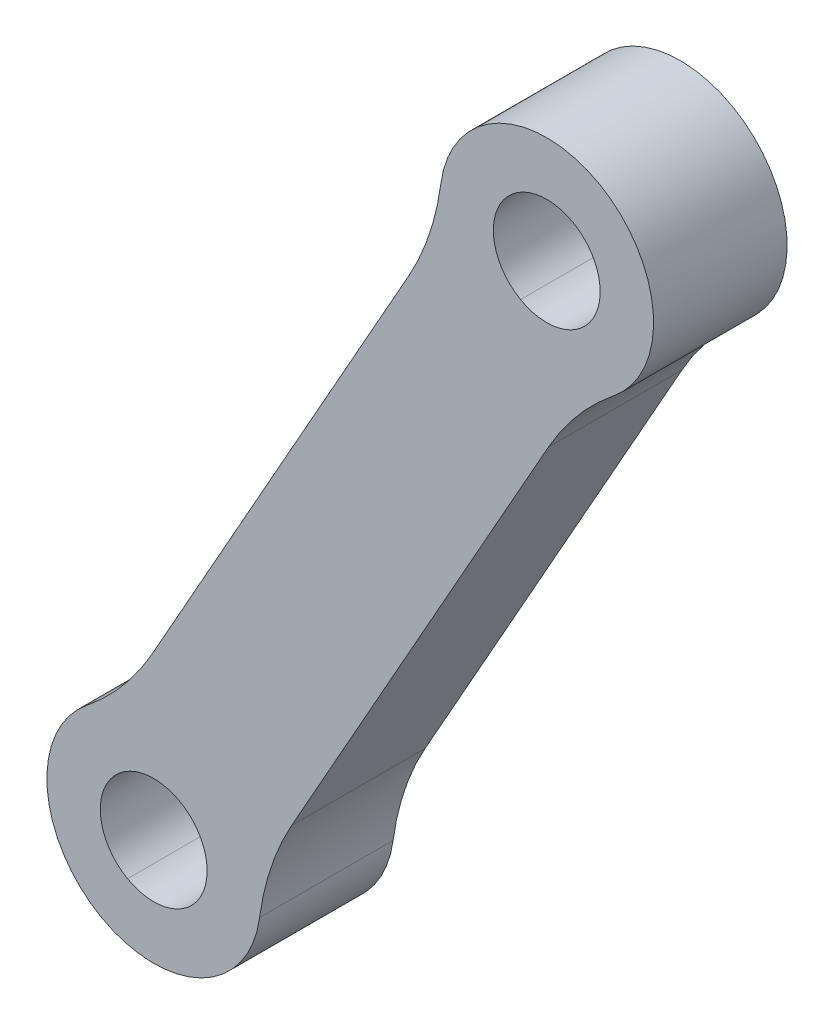
ISO-10303-21;
HEADER;
FILE_DESCRIPTION(('STEP AP214'),'2;1');
FILE_NAME('part.step','',(''),(''),'','','');
FILE_SCHEMA(('AUTOMOTIVE_DESIGN { 1 0 10303 214 1 1 1 1 }'));
ENDSEC;
DATA;
#1=APPLICATION_CONTEXT('core data for automotive mechanical design processes');
#2=APPLICATION_PROTOCOL_DEFINITION('international standard','automotive_design',2000,#1);
#3=PRODUCT_CONTEXT('',#1,'mechanical');
#4=PRODUCT('Part','Part','',(#3));
#5=PRODUCT_RELATED_PRODUCT_CATEGORY('part','',(#4));
#6=PRODUCT_DEFINITION_FORMATION('','',#4);
#7=PRODUCT_DEFINITION_CONTEXT('part definition',#1,'design');
#8=PRODUCT_DEFINITION('design','',#6,#7);
#9=PRODUCT_DEFINITION_SHAPE('','',#8);
#10=(LENGTH_UNIT() NAMED_UNIT(*) SI_UNIT(.MILLI.,.METRE.));
#11=(NAMED_UNIT(*) PLANE_ANGLE_UNIT() SI_UNIT($,.RADIAN.));
#12=(NAMED_UNIT(*) SI_UNIT($,.STERADIAN.) SOLID_ANGLE_UNIT());
#13=UNCERTAINTY_MEASURE_WITH_UNIT(LENGTH_MEASURE(1.E-05),#10,'distance_accuracy_value','');
#14=(GEOMETRIC_REPRESENTATION_CONTEXT(3) GLOBAL_UNCERTAINTY_ASSIGNED_CONTEXT((#13)) GLOBAL_UNIT_ASSIGNED_CONTEXT((#10,
#11,#12)) REPRESENTATION_CONTEXT('',''));
#15=CARTESIAN_POINT('',(0.,0.,0.));
#16=DIRECTION('',(0.,0.,1.));
#17=DIRECTION('',(1.,0.,0.));
#18=AXIS2_PLACEMENT_3D('',#15,#16,#17);
#19=CARTESIAN_POINT('',(-0.531717418703122,23.0499455973886,63.));
#20=DIRECTION('',(0.,0.,-1.));
#21=DIRECTION('',(-0.490636080013694,-0.871364583276596,0.));
#22=AXIS2_PLACEMENT_3D('',#19,#20,#21);
#23=CYLINDRICAL_SURFACE('',#22,10.);
#24=CARTESIAN_POINT('',(-0.531717418703122,23.0499455973886,63.));
#25=DIRECTION('',(0.,0.,-1.));
#26=DIRECTION('',(0.490636080013693,0.871364583276597,0.));
#27=AXIS2_PLACEMENT_3D('',#24,#25,#26);
#28=CIRCLE('',#27,10.);
#29=CARTESIAN_POINT('',(8.18192841406284,18.1435847972517,63.));
#30=VERTEX_POINT('',#29);
#31=CARTESIAN_POINT('',(5.73851095755783,15.2599368612233,63.));
#32=VERTEX_POINT('',#31);
#33=EDGE_CURVE('E202',#30,#32,#28,.T.);
#34=ORIENTED_EDGE('',*,*,#33,.F.);
#35=DIRECTION('',(0.,0.,1.));
#36=VECTOR('',#35,1.);
#37=CARTESIAN_POINT('',(8.18192841406284,18.1435847972517,63.));
#38=LINE('',#37,#36);
#39=CARTESIAN_POINT('',(8.18192841406284,18.1435847972517,58.));
#40=VERTEX_POINT('',#39);
#41=EDGE_CURVE('E279',#40,#30,#38,.T.);
#42=ORIENTED_EDGE('',*,*,#41,.F.);
#43=CARTESIAN_POINT('',(-0.531717418703122,23.0499455973886,58.));
#44=DIRECTION('',(0.,0.,1.));
#45=DIRECTION('',(0.490636080013694,0.871364583276596,0.));
#46=AXIS2_PLACEMENT_3D('',#43,#44,#45);
#47=CIRCLE('',#46,10.);
#48=CARTESIAN_POINT('',(5.73851095755783,15.2599368612233,58.));
#49=VERTEX_POINT('',#48);
#50=EDGE_CURVE('E28',#49,#40,#47,.T.);
#51=ORIENTED_EDGE('',*,*,#50,.F.);
#52=DIRECTION('',(0.,0.,-1.));
#53=VECTOR('',#52,1.);
#54=CARTESIAN_POINT('',(5.73851095755783,15.2599368612233,63.));
#55=LINE('',#54,#53);
#56=EDGE_CURVE('E151',#32,#49,#55,.T.);
#57=ORIENTED_EDGE('',*,*,#56,.F.);
#58=EDGE_LOOP('',(#34,#42,#51,#57));
#59=FACE_BOUND('',#58,.T.);
#60=ADVANCED_FACE('F17',(#59),#23,.F.);
#61=CARTESIAN_POINT('',(9.08852527004682,40.1353967147796,63.));
#62=DIRECTION('',(0.,0.,-1.));
#63=DIRECTION('',(-0.490636080013694,-0.871364583276596,0.));
#64=AXIS2_PLACEMENT_3D('',#61,#62,#63);
#65=CYLINDRICAL_SURFACE('',#64,10.);
#66=CARTESIAN_POINT('',(9.08852527004682,40.1353967147796,63.));
#67=DIRECTION('',(0.,0.,-1.));
#68=DIRECTION('',(0.490636080013693,0.871364583276597,0.));
#69=AXIS2_PLACEMENT_3D('',#66,#67,#68);
#70=CIRCLE('',#69,10.);
#71=CARTESIAN_POINT('',(19.0007820117798,38.8135925364049,63.));
#72=VERTEX_POINT('',#71);
#73=CARTESIAN_POINT('',(17.8021711028128,35.2290359146427,63.));
#74=VERTEX_POINT('',#73);
#75=EDGE_CURVE('E205',#72,#74,#70,.T.);
#76=ORIENTED_EDGE('',*,*,#75,.F.);
#77=DIRECTION('',(0.,0.,1.));
#78=VECTOR('',#77,1.);
#79=CARTESIAN_POINT('',(19.0007820117798,38.8135925364049,63.));
#80=LINE('',#79,#78);
#81=CARTESIAN_POINT('',(19.0007820117798,38.8135925364049,58.));
#82=VERTEX_POINT('',#81);
#83=EDGE_CURVE('E269',#82,#72,#80,.T.);
#84=ORIENTED_EDGE('',*,*,#83,.F.);
#85=CARTESIAN_POINT('',(9.08852527004682,40.1353967147796,58.));
#86=DIRECTION('',(0.,0.,1.));
#87=DIRECTION('',(0.490636080013694,0.871364583276596,0.));
#88=AXIS2_PLACEMENT_3D('',#85,#86,#87);
#89=CIRCLE('',#88,10.);
#90=CARTESIAN_POINT('',(17.8021711028128,35.2290359146427,58.));
#91=VERTEX_POINT('',#90);
#92=EDGE_CURVE('E11',#91,#82,#89,.T.);
#93=ORIENTED_EDGE('',*,*,#92,.F.);
#94=DIRECTION('',(0.,0.,-1.));
#95=VECTOR('',#94,1.);
#96=CARTESIAN_POINT('',(17.8021711028128,35.2290359146427,63.));
#97=LINE('',#96,#95);
#98=EDGE_CURVE('E191',#74,#91,#97,.T.);
#99=ORIENTED_EDGE('',*,*,#98,.F.);
#100=EDGE_LOOP('',(#76,#84,#93,#99));
#101=FACE_BOUND('',#100,.T.);
#102=ADVANCED_FACE('F318',(#101),#65,.F.);
#103=CARTESIAN_POINT('',(22.1237617464884,10.2934075170326,63.));
#104=DIRECTION('',(0.,0.,-1.));
#105=DIRECTION('',(-0.490636080013694,-0.871364583276596,0.));
#106=AXIS2_PLACEMENT_3D('',#103,#104,#105);
#107=CYLINDRICAL_SURFACE('',#106,10.);
#108=CARTESIAN_POINT('',(22.1237617464884,10.2934075170326,63.));
#109=DIRECTION('',(0.,0.,-1.));
#110=DIRECTION('',(0.490636080013694,0.871364583276596,0.));
#111=AXIS2_PLACEMENT_3D('',#108,#109,#110);
#112=CIRCLE('',#111,10.);
#113=CARTESIAN_POINT('',(12.2115050047554,11.6152116954073,63.));
#114=VERTEX_POINT('',#113);
#115=CARTESIAN_POINT('',(13.4101159137224,15.1997683171695,63.));
#116=VERTEX_POINT('',#115);
#117=EDGE_CURVE('E42',#114,#116,#112,.T.);
#118=ORIENTED_EDGE('',*,*,#117,.F.);
#119=DIRECTION('',(0.,0.,1.));
#120=VECTOR('',#119,1.);
#121=CARTESIAN_POINT('',(12.2115050047554,11.6152116954073,63.));
#122=LINE('',#121,#120);
#123=CARTESIAN_POINT('',(12.2115050047554,11.6152116954073,58.));
#124=VERTEX_POINT('',#123);
#125=EDGE_CURVE('E166',#124,#114,#122,.T.);
#126=ORIENTED_EDGE('',*,*,#125,.F.);
#127=CARTESIAN_POINT('',(22.1237617464884,10.2934075170326,58.));
#128=DIRECTION('',(0.,0.,1.));
#129=DIRECTION('',(0.490636080013694,0.871364583276596,0.));
#130=AXIS2_PLACEMENT_3D('',#127,#128,#129);
#131=CIRCLE('',#130,10.);
#132=CARTESIAN_POINT('',(13.4101159137224,15.1997683171695,58.));
#133=VERTEX_POINT('',#132);
#134=EDGE_CURVE('E161',#133,#124,#131,.T.);
#135=ORIENTED_EDGE('',*,*,#134,.F.);
#136=DIRECTION('',(0.,0.,-1.));
#137=VECTOR('',#136,1.);
#138=CARTESIAN_POINT('',(13.4101159137224,15.1997683171695,58.));
#139=LINE('',#138,#137);
#140=EDGE_CURVE('E229',#116,#133,#139,.T.);
#141=ORIENTED_EDGE('',*,*,#140,.F.);
#142=EDGE_LOOP('',(#118,#126,#135,#141));
#143=FACE_BOUND('',#142,.T.);
#144=ADVANCED_FACE('F440',(#143),#107,.F.);
#145=CARTESIAN_POINT('',(31.7440044352383,27.3788586344236,63.));
#146=DIRECTION('',(0.,0.,-1.));
#147=DIRECTION('',(-0.490636080013694,-0.871364583276596,0.));
#148=AXIS2_PLACEMENT_3D('',#145,#146,#147);
#149=CYLINDRICAL_SURFACE('',#148,10.);
#150=CARTESIAN_POINT('',(31.7440044352383,27.3788586344236,63.));
#151=DIRECTION('',(0.,0.,-1.));
#152=DIRECTION('',(0.490636080013696,0.871364583276595,0.));
#153=AXIS2_PLACEMENT_3D('',#150,#151,#152);
#154=CIRCLE('',#153,10.);
#155=CARTESIAN_POINT('',(23.0303586024724,32.2852194345605,63.));
#156=VERTEX_POINT('',#155);
#157=CARTESIAN_POINT('',(25.4737760589774,35.1688673705889,63.));
#158=VERTEX_POINT('',#157);
#159=EDGE_CURVE('E237',#156,#158,#154,.T.);
#160=ORIENTED_EDGE('',*,*,#159,.F.);
#161=DIRECTION('',(0.,0.,1.));
#162=VECTOR('',#161,1.);
#163=CARTESIAN_POINT('',(23.0303586024724,32.2852194345605,63.));
#164=LINE('',#163,#162);
#165=CARTESIAN_POINT('',(23.0303586024724,32.2852194345605,58.));
#166=VERTEX_POINT('',#165);
#167=EDGE_CURVE('E216',#166,#156,#164,.T.);
#168=ORIENTED_EDGE('',*,*,#167,.F.);
#169=CARTESIAN_POINT('',(31.7440044352383,27.3788586344236,58.));
#170=DIRECTION('',(0.,0.,1.));
#171=DIRECTION('',(0.490636080013694,0.871364583276596,0.));
#172=AXIS2_PLACEMENT_3D('',#169,#170,#171);
#173=CIRCLE('',#172,10.);
#174=CARTESIAN_POINT('',(25.4737760589774,35.1688673705889,58.));
#175=VERTEX_POINT('',#174);
#176=EDGE_CURVE('E21',#175,#166,#173,.T.);
#177=ORIENTED_EDGE('',*,*,#176,.F.);
#178=DIRECTION('',(0.,0.,-1.));
#179=VECTOR('',#178,1.);
#180=CARTESIAN_POINT('',(25.4737760589774,35.1688673705889,63.));
#181=LINE('',#180,#179);
#182=EDGE_CURVE('E190',#158,#175,#181,.T.);
#183=ORIENTED_EDGE('',*,*,#182,.F.);
#184=EDGE_LOOP('',(#160,#168,#177,#183));
#185=FACE_BOUND('',#184,.T.);
#186=ADVANCED_FACE('F236',(#185),#149,.F.);
#187=CARTESIAN_POINT('',(37.313795332256,36.631059521741,58.));
#188=DIRECTION('',(0.,0.,1.));
#189=DIRECTION('',(0.490636080013694,0.871364583276596,0.));
#190=AXIS2_PLACEMENT_3D('',#187,#188,#189);
#191=PLANE('',#190);
#192=CARTESIAN_POINT('',(22.965684708473,38.284870865055,58.));
#193=DIRECTION('',(0.,0.,1.));
#194=DIRECTION('',(0.490636080013694,0.871364583276596,0.));
#195=AXIS2_PLACEMENT_3D('',#192,#193,#194);
#196=CIRCLE('',#195,2.);
#197=CARTESIAN_POINT('',(21.9844125484457,36.5421416985018,58.));
#198=VERTEX_POINT('',#197);
#199=CARTESIAN_POINT('',(23.9469568685004,40.0276000316082,58.));
#200=VERTEX_POINT('',#199);
#201=EDGE_CURVE('E215',#198,#200,#196,.T.);
#202=ORIENTED_EDGE('',*,*,#201,.T.);
#203=CARTESIAN_POINT('',(22.965684708473,38.284870865055,58.));
#204=DIRECTION('',(0.,0.,1.));
#205=DIRECTION('',(0.490636080013694,0.871364583276596,0.));
#206=AXIS2_PLACEMENT_3D('',#203,#204,#205);
#207=CIRCLE('',#206,2.);
#208=EDGE_CURVE('E288',#200,#198,#207,.T.);
#209=ORIENTED_EDGE('',*,*,#208,.T.);
#210=EDGE_LOOP('',(#202,#209));
#211=FACE_BOUND('',#210,.T.);
#212=CARTESIAN_POINT('',(8.24660230806223,12.1439333667572,58.));
#213=DIRECTION('',(0.,0.,1.));
#214=DIRECTION('',(0.490636080013694,0.871364583276596,0.));
#215=AXIS2_PLACEMENT_3D('',#212,#213,#214);
#216=CIRCLE('',#215,2.);
#217=CARTESIAN_POINT('',(7.26533014803481,10.4012042002039,58.));
#218=VERTEX_POINT('',#217);
#219=CARTESIAN_POINT('',(9.22787446808961,13.8866625333104,58.));
#220=VERTEX_POINT('',#219);
#221=EDGE_CURVE('E254',#218,#220,#216,.T.);
#222=ORIENTED_EDGE('',*,*,#221,.T.);
#223=CARTESIAN_POINT('',(8.24660230806223,12.1439333667572,58.));
#224=DIRECTION('',(0.,0.,1.));
#225=DIRECTION('',(0.490636080013694,0.871364583276596,0.));
#226=AXIS2_PLACEMENT_3D('',#223,#224,#225);
#227=CIRCLE('',#226,2.);
#228=EDGE_CURVE('E197',#220,#218,#227,.T.);
#229=ORIENTED_EDGE('',*,*,#228,.T.);
#230=EDGE_LOOP('',(#222,#229));
#231=FACE_BOUND('',#230,.T.);
#232=CARTESIAN_POINT('',(22.965684708473,38.284870865055,58.));
#233=DIRECTION('',(0.,0.,1.));
#234=DIRECTION('',(0.490636080013694,0.871364583276596,0.));
#235=AXIS2_PLACEMENT_3D('',#232,#233,#234);
#236=CIRCLE('',#235,4.);
#237=EDGE_CURVE('E232',#175,#82,#236,.T.);
#238=ORIENTED_EDGE('',*,*,#237,.F.);
#239=ORIENTED_EDGE('',*,*,#176,.T.);
#240=DIRECTION('',(0.490636080013694,0.871364583276596,0.));
#241=VECTOR('',#240,1.);
#242=CARTESIAN_POINT('',(28.3266674125888,41.69140888378,58.));
#243=LINE('',#242,#241);
#244=EDGE_CURVE('E200',#133,#166,#243,.T.);
#245=ORIENTED_EDGE('',*,*,#244,.F.);
#246=ORIENTED_EDGE('',*,*,#134,.T.);
#247=CARTESIAN_POINT('',(8.24660230806223,12.1439333667572,58.));
#248=DIRECTION('',(0.,0.,1.));
#249=DIRECTION('',(0.490636080013694,0.871364583276596,0.));
#250=AXIS2_PLACEMENT_3D('',#247,#248,#249);
#251=CIRCLE('',#250,4.);
#252=CARTESIAN_POINT('',(6.28405798800745,8.65847503365079,58.));
#253=VERTEX_POINT('',#252);
#254=EDGE_CURVE('E157',#253,#124,#251,.T.);
#255=ORIENTED_EDGE('',*,*,#254,.F.);
#256=CARTESIAN_POINT('',(8.24660230806223,12.1439333667572,58.));
#257=DIRECTION('',(0.,0.,1.));
#258=DIRECTION('',(0.490636080013694,0.871364583276596,0.));
#259=AXIS2_PLACEMENT_3D('',#256,#257,#258);
#260=CIRCLE('',#259,4.);
#261=EDGE_CURVE('E143',#49,#253,#260,.T.);
#262=ORIENTED_EDGE('',*,*,#261,.F.);
#263=ORIENTED_EDGE('',*,*,#50,.T.);
#264=DIRECTION('',(0.490636080013694,0.871364583276596,0.));
#265=VECTOR('',#264,1.);
#266=CARTESIAN_POINT('',(23.0984799129292,44.6352253638622,58.));
#267=LINE('',#266,#265);
#268=EDGE_CURVE('E195',#40,#91,#267,.T.);
#269=ORIENTED_EDGE('',*,*,#268,.T.);
#270=ORIENTED_EDGE('',*,*,#92,.T.);
#271=EDGE_LOOP('',(#238,#239,#245,#246,#255,#262,#263,#269,#270));
#272=FACE_BOUND('',#271,.T.);
#273=ADVANCED_FACE('F159',(#211,#231,#272),#191,.F.);
#274=CARTESIAN_POINT('',(37.313795332256,36.631059521741,63.));
#275=DIRECTION('',(0.,0.,1.));
#276=DIRECTION('',(0.490636080013694,0.871364583276596,0.));
#277=AXIS2_PLACEMENT_3D('',#274,#275,#276);
#278=PLANE('',#277);
#279=CARTESIAN_POINT('',(22.965684708473,38.284870865055,63.));
#280=DIRECTION('',(0.,0.,1.));
#281=DIRECTION('',(0.490636080013694,0.871364583276596,0.));
#282=AXIS2_PLACEMENT_3D('',#279,#280,#281);
#283=CIRCLE('',#282,2.);
#284=CARTESIAN_POINT('',(21.9844125484457,36.5421416985018,63.));
#285=VERTEX_POINT('',#284);
#286=CARTESIAN_POINT('',(23.9469568685004,40.0276000316082,63.));
#287=VERTEX_POINT('',#286);
#288=EDGE_CURVE('E206',#285,#287,#283,.T.);
#289=ORIENTED_EDGE('',*,*,#288,.F.);
#290=CARTESIAN_POINT('',(22.965684708473,38.284870865055,63.));
#291=DIRECTION('',(0.,0.,1.));
#292=DIRECTION('',(0.490636080013694,0.871364583276596,0.));
#293=AXIS2_PLACEMENT_3D('',#290,#291,#292);
#294=CIRCLE('',#293,2.);
#295=EDGE_CURVE('E154',#287,#285,#294,.T.);
#296=ORIENTED_EDGE('',*,*,#295,.F.);
#297=EDGE_LOOP('',(#289,#296));
#298=FACE_BOUND('',#297,.T.);
#299=CARTESIAN_POINT('',(8.24660230806223,12.1439333667572,63.));
#300=DIRECTION('',(0.,0.,1.));
#301=DIRECTION('',(0.490636080013694,0.871364583276596,0.));
#302=AXIS2_PLACEMENT_3D('',#299,#300,#301);
#303=CIRCLE('',#302,2.);
#304=CARTESIAN_POINT('',(7.26533014803481,10.4012042002039,63.));
#305=VERTEX_POINT('',#304);
#306=CARTESIAN_POINT('',(9.22787446808961,13.8866625333104,63.));
#307=VERTEX_POINT('',#306);
#308=EDGE_CURVE('E182',#305,#307,#303,.T.);
#309=ORIENTED_EDGE('',*,*,#308,.F.);
#310=CARTESIAN_POINT('',(8.24660230806223,12.1439333667572,63.));
#311=DIRECTION('',(0.,0.,1.));
#312=DIRECTION('',(0.490636080013694,0.871364583276596,0.));
#313=AXIS2_PLACEMENT_3D('',#310,#311,#312);
#314=CIRCLE('',#313,2.);
#315=EDGE_CURVE('E201',#307,#305,#314,.T.);
#316=ORIENTED_EDGE('',*,*,#315,.F.);
#317=EDGE_LOOP('',(#309,#316));
#318=FACE_BOUND('',#317,.T.);
#319=DIRECTION('',(0.490636080013694,0.871364583276596,0.));
#320=VECTOR('',#319,1.);
#321=CARTESIAN_POINT('',(28.3266674125888,41.69140888378,63.));
#322=LINE('',#321,#320);
#323=EDGE_CURVE('E219',#116,#156,#322,.T.);
#324=ORIENTED_EDGE('',*,*,#323,.T.);
#325=ORIENTED_EDGE('',*,*,#159,.T.);
#326=CARTESIAN_POINT('',(22.965684708473,38.284870865055,63.));
#327=DIRECTION('',(0.,0.,1.));
#328=DIRECTION('',(0.490636080013694,0.871364583276596,0.));
#329=AXIS2_PLACEMENT_3D('',#326,#327,#328);
#330=CIRCLE('',#329,4.);
#331=EDGE_CURVE('E186',#158,#72,#330,.T.);
#332=ORIENTED_EDGE('',*,*,#331,.T.);
#333=ORIENTED_EDGE('',*,*,#75,.T.);
#334=DIRECTION('',(0.490636080013694,0.871364583276596,0.));
#335=VECTOR('',#334,1.);
#336=CARTESIAN_POINT('',(23.0984799129292,44.6352253638622,63.));
#337=LINE('',#336,#335);
#338=EDGE_CURVE('E196',#30,#74,#337,.T.);
#339=ORIENTED_EDGE('',*,*,#338,.F.);
#340=ORIENTED_EDGE('',*,*,#33,.T.);
#341=CARTESIAN_POINT('',(8.24660230806223,12.1439333667572,63.));
#342=DIRECTION('',(0.,0.,1.));
#343=DIRECTION('',(0.490636080013694,0.871364583276596,0.));
#344=AXIS2_PLACEMENT_3D('',#341,#342,#343);
#345=CIRCLE('',#344,4.);
#346=CARTESIAN_POINT('',(6.28405798800745,8.65847503365079,63.));
#347=VERTEX_POINT('',#346);
#348=EDGE_CURVE('E276',#32,#347,#345,.T.);
#349=ORIENTED_EDGE('',*,*,#348,.T.);
#350=CARTESIAN_POINT('',(8.24660230806223,12.1439333667572,63.));
#351=DIRECTION('',(0.,0.,1.));
#352=DIRECTION('',(0.490636080013694,0.871364583276596,0.));
#353=AXIS2_PLACEMENT_3D('',#350,#351,#352);
#354=CIRCLE('',#353,4.);
#355=EDGE_CURVE('E169',#347,#114,#354,.T.);
#356=ORIENTED_EDGE('',*,*,#355,.T.);
#357=ORIENTED_EDGE('',*,*,#117,.T.);
#358=EDGE_LOOP('',(#324,#325,#332,#333,#339,#340,#349,#356,#357));
#359=FACE_BOUND('',#358,.T.);
#360=ADVANCED_FACE('F241',(#298,#318,#359),#278,.T.);
#361=CARTESIAN_POINT('',(28.3266674125888,41.69140888378,63.));
#362=DIRECTION('',(-0.871364583276596,0.490636080013694,0.));
#363=DIRECTION('',(0.490636080013694,0.871364583276596,0.));
#364=AXIS2_PLACEMENT_3D('',#361,#362,#363);
#365=PLANE('',#364);
#366=ORIENTED_EDGE('',*,*,#244,.T.);
#367=ORIENTED_EDGE('',*,*,#167,.T.);
#368=ORIENTED_EDGE('',*,*,#323,.F.);
#369=ORIENTED_EDGE('',*,*,#140,.T.);
#370=EDGE_LOOP('',(#366,#367,#368,#369));
#371=FACE_BOUND('',#370,.T.);
#372=ADVANCED_FACE('F19',(#371),#365,.F.);
#373=CARTESIAN_POINT('',(8.24660230806223,12.1439333667572,63.));
#374=DIRECTION('',(0.,0.,-1.));
#375=DIRECTION('',(-0.490636080013694,-0.871364583276596,0.));
#376=AXIS2_PLACEMENT_3D('',#373,#374,#375);
#377=CYLINDRICAL_SURFACE('',#376,2.);
#378=DIRECTION('',(0.,0.,-1.));
#379=VECTOR('',#378,1.);
#380=CARTESIAN_POINT('',(9.22787446808961,13.8866625333104,63.));
#381=LINE('',#380,#379);
#382=EDGE_CURVE('E184',#307,#220,#381,.T.);
#383=ORIENTED_EDGE('',*,*,#382,.F.);
#384=ORIENTED_EDGE('',*,*,#315,.T.);
#385=DIRECTION('',(0.,0.,-1.));
#386=VECTOR('',#385,1.);
#387=CARTESIAN_POINT('',(7.26533014803481,10.4012042002039,63.));
#388=LINE('',#387,#386);
#389=EDGE_CURVE('E210',#305,#218,#388,.T.);
#390=ORIENTED_EDGE('',*,*,#389,.T.);
#391=ORIENTED_EDGE('',*,*,#228,.F.);
#392=EDGE_LOOP('',(#383,#384,#390,#391));
#393=FACE_BOUND('',#392,.T.);
#394=ADVANCED_FACE('F436',(#393),#377,.F.);
#395=CARTESIAN_POINT('',(22.965684708473,38.284870865055,63.));
#396=DIRECTION('',(0.,0.,-1.));
#397=DIRECTION('',(-0.490636080013694,-0.871364583276596,0.));
#398=AXIS2_PLACEMENT_3D('',#395,#396,#397);
#399=CYLINDRICAL_SURFACE('',#398,2.);
#400=DIRECTION('',(0.,0.,-1.));
#401=VECTOR('',#400,1.);
#402=CARTESIAN_POINT('',(23.9469568685004,40.0276000316082,63.));
#403=LINE('',#402,#401);
#404=EDGE_CURVE('E209',#287,#200,#403,.T.);
#405=ORIENTED_EDGE('',*,*,#404,.F.);
#406=ORIENTED_EDGE('',*,*,#295,.T.);
#407=DIRECTION('',(0.,0.,-1.));
#408=VECTOR('',#407,1.);
#409=CARTESIAN_POINT('',(21.9844125484457,36.5421416985018,63.));
#410=LINE('',#409,#408);
#411=EDGE_CURVE('E177',#285,#198,#410,.T.);
#412=ORIENTED_EDGE('',*,*,#411,.T.);
#413=ORIENTED_EDGE('',*,*,#208,.F.);
#414=EDGE_LOOP('',(#405,#406,#412,#413));
#415=FACE_BOUND('',#414,.T.);
#416=ADVANCED_FACE('F451',(#415),#399,.F.);
#417=CARTESIAN_POINT('',(8.24660230806223,12.1439333667572,63.));
#418=DIRECTION('',(0.,0.,-1.));
#419=DIRECTION('',(-0.490636080013694,-0.871364583276596,0.));
#420=AXIS2_PLACEMENT_3D('',#417,#418,#419);
#421=CYLINDRICAL_SURFACE('',#420,4.);
#422=DIRECTION('',(0.,0.,-1.));
#423=VECTOR('',#422,1.);
#424=CARTESIAN_POINT('',(6.28405798800745,8.65847503365079,63.));
#425=LINE('',#424,#423);
#426=EDGE_CURVE('E148',#347,#253,#425,.T.);
#427=ORIENTED_EDGE('',*,*,#426,.F.);
#428=ORIENTED_EDGE('',*,*,#348,.F.);
#429=ORIENTED_EDGE('',*,*,#56,.T.);
#430=ORIENTED_EDGE('',*,*,#261,.T.);
#431=EDGE_LOOP('',(#427,#428,#429,#430));
#432=FACE_BOUND('',#431,.T.);
#433=ADVANCED_FACE('F145',(#432),#421,.T.);
#434=CARTESIAN_POINT('',(23.0984799129292,44.6352253638622,63.));
#435=DIRECTION('',(-0.871364583276596,0.490636080013694,0.));
#436=DIRECTION('',(0.490636080013694,0.871364583276596,0.));
#437=AXIS2_PLACEMENT_3D('',#434,#435,#436);
#438=PLANE('',#437);
#439=ORIENTED_EDGE('',*,*,#338,.T.);
#440=ORIENTED_EDGE('',*,*,#98,.T.);
#441=ORIENTED_EDGE('',*,*,#268,.F.);
#442=ORIENTED_EDGE('',*,*,#41,.T.);
#443=EDGE_LOOP('',(#439,#440,#441,#442));
#444=FACE_BOUND('',#443,.T.);
#445=ADVANCED_FACE('F315',(#444),#438,.T.);
#446=CARTESIAN_POINT('',(22.965684708473,38.284870865055,63.));
#447=DIRECTION('',(0.,0.,-1.));
#448=DIRECTION('',(-0.490636080013694,-0.871364583276596,0.));
#449=AXIS2_PLACEMENT_3D('',#446,#447,#448);
#450=CYLINDRICAL_SURFACE('',#449,4.);
#451=ORIENTED_EDGE('',*,*,#331,.F.);
#452=ORIENTED_EDGE('',*,*,#182,.T.);
#453=ORIENTED_EDGE('',*,*,#237,.T.);
#454=ORIENTED_EDGE('',*,*,#83,.T.);
#455=EDGE_LOOP('',(#451,#452,#453,#454));
#456=FACE_BOUND('',#455,.T.);
#457=ADVANCED_FACE('F321',(#456),#450,.T.);
#458=CARTESIAN_POINT('',(8.24660230806223,12.1439333667572,63.));
#459=DIRECTION('',(0.,0.,-1.));
#460=DIRECTION('',(-0.490636080013694,-0.871364583276596,0.));
#461=AXIS2_PLACEMENT_3D('',#458,#459,#460);
#462=CYLINDRICAL_SURFACE('',#461,4.);
#463=ORIENTED_EDGE('',*,*,#355,.F.);
#464=ORIENTED_EDGE('',*,*,#426,.T.);
#465=ORIENTED_EDGE('',*,*,#254,.T.);
#466=ORIENTED_EDGE('',*,*,#125,.T.);
#467=EDGE_LOOP('',(#463,#464,#465,#466));
#468=FACE_BOUND('',#467,.T.);
#469=ADVANCED_FACE('F168',(#468),#462,.T.);
#470=CARTESIAN_POINT('',(22.965684708473,38.284870865055,63.));
#471=DIRECTION('',(0.,0.,-1.));
#472=DIRECTION('',(-0.490636080013694,-0.871364583276596,0.));
#473=AXIS2_PLACEMENT_3D('',#470,#471,#472);
#474=CYLINDRICAL_SURFACE('',#473,2.);
#475=ORIENTED_EDGE('',*,*,#288,.T.);
#476=ORIENTED_EDGE('',*,*,#404,.T.);
#477=ORIENTED_EDGE('',*,*,#201,.F.);
#478=ORIENTED_EDGE('',*,*,#411,.F.);
#479=EDGE_LOOP('',(#475,#476,#477,#478));
#480=FACE_BOUND('',#479,.T.);
#481=ADVANCED_FACE('F489',(#480),#474,.F.);
#482=CARTESIAN_POINT('',(8.24660230806223,12.1439333667572,63.));
#483=DIRECTION('',(0.,0.,-1.));
#484=DIRECTION('',(-0.490636080013694,-0.871364583276596,0.));
#485=AXIS2_PLACEMENT_3D('',#482,#483,#484);
#486=CYLINDRICAL_SURFACE('',#485,2.);
#487=ORIENTED_EDGE('',*,*,#308,.T.);
#488=ORIENTED_EDGE('',*,*,#382,.T.);
#489=ORIENTED_EDGE('',*,*,#221,.F.);
#490=ORIENTED_EDGE('',*,*,#389,.F.);
#491=EDGE_LOOP('',(#487,#488,#489,#490));
#492=FACE_BOUND('',#491,.T.);
#493=ADVANCED_FACE('F485',(#492),#486,.F.);
#494=CLOSED_SHELL('',(#60,#102,#144,#186,#273,#360,#372,#394,#416,#433,#445,#457,#469,#481,#493));
#495=MANIFOLD_SOLID_BREP('B1',#494);
#496=ADVANCED_BREP_SHAPE_REPRESENTATION('',(#18,#495),#14);
#497=SHAPE_DEFINITION_REPRESENTATION(#9,#496);
ENDSEC;
END-ISO-10303-21;
